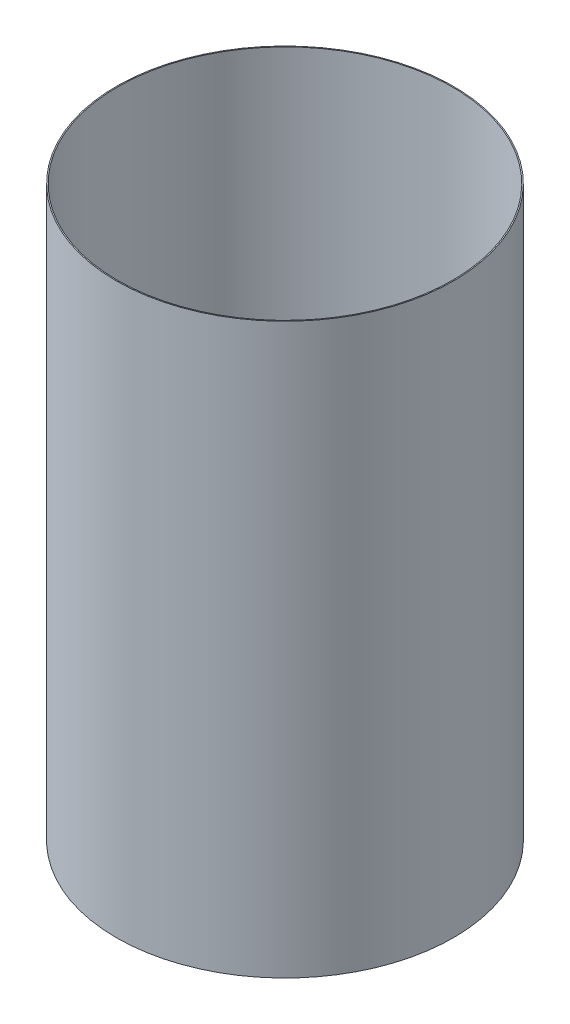
ISO-10303-21;
HEADER;
FILE_DESCRIPTION(('STEP AP214'),'2;1');
FILE_NAME('part.step','',(''),(''),'','','');
FILE_SCHEMA(('AUTOMOTIVE_DESIGN { 1 0 10303 214 1 1 1 1 }'));
ENDSEC;
DATA;
#1=APPLICATION_CONTEXT('core data for automotive mechanical design processes');
#2=APPLICATION_PROTOCOL_DEFINITION('international standard','automotive_design',2000,#1);
#3=PRODUCT_CONTEXT('',#1,'mechanical');
#4=PRODUCT('Part','Part','',(#3));
#5=PRODUCT_RELATED_PRODUCT_CATEGORY('part','',(#4));
#6=PRODUCT_DEFINITION_FORMATION('','',#4);
#7=PRODUCT_DEFINITION_CONTEXT('part definition',#1,'design');
#8=PRODUCT_DEFINITION('design','',#6,#7);
#9=PRODUCT_DEFINITION_SHAPE('','',#8);
#10=(LENGTH_UNIT() NAMED_UNIT(*) SI_UNIT(.MILLI.,.METRE.));
#11=(NAMED_UNIT(*) PLANE_ANGLE_UNIT() SI_UNIT($,.RADIAN.));
#12=(NAMED_UNIT(*) SI_UNIT($,.STERADIAN.) SOLID_ANGLE_UNIT());
#13=UNCERTAINTY_MEASURE_WITH_UNIT(LENGTH_MEASURE(1.E-05),#10,'distance_accuracy_value','');
#14=(GEOMETRIC_REPRESENTATION_CONTEXT(3) GLOBAL_UNCERTAINTY_ASSIGNED_CONTEXT((#13)) GLOBAL_UNIT_ASSIGNED_CONTEXT((#10,
#11,#12)) REPRESENTATION_CONTEXT('',''));
#15=CARTESIAN_POINT('',(0.,0.,0.));
#16=DIRECTION('',(0.,0.,1.));
#17=DIRECTION('',(1.,0.,0.));
#18=AXIS2_PLACEMENT_3D('',#15,#16,#17);
#19=CARTESIAN_POINT('',(0.,55.,0.));
#20=DIRECTION('',(0.,1.,0.));
#21=DIRECTION('',(0.,0.,1.));
#22=AXIS2_PLACEMENT_3D('',#19,#20,#21);
#23=CYLINDRICAL_SURFACE('',#22,39.5224);
#24=CARTESIAN_POINT('',(0.,-202.353193409573,0.));
#25=DIRECTION('',(0.,1.,0.));
#26=DIRECTION('',(0.,0.,1.));
#27=AXIS2_PLACEMENT_3D('',#24,#25,#26);
#28=CIRCLE('',#27,39.5224);
#29=CARTESIAN_POINT('',(0.,-202.353193409573,39.5224));
#30=VERTEX_POINT('',#29);
#31=EDGE_CURVE('E44',#30,#30,#28,.T.);
#32=ORIENTED_EDGE('',*,*,#31,.T.);
#33=EDGE_LOOP('',(#32));
#34=FACE_BOUND('',#33,.T.);
#35=CARTESIAN_POINT('',(0.,-69.0031934095732,0.));
#36=DIRECTION('',(0.,1.,0.));
#37=DIRECTION('',(0.,0.,1.));
#38=AXIS2_PLACEMENT_3D('',#35,#36,#37);
#39=CIRCLE('',#38,39.5224);
#40=CARTESIAN_POINT('',(0.,-69.0031934095732,39.5224));
#41=VERTEX_POINT('',#40);
#42=EDGE_CURVE('E10',#41,#41,#39,.T.);
#43=ORIENTED_EDGE('',*,*,#42,.F.);
#44=EDGE_LOOP('',(#43));
#45=FACE_BOUND('',#44,.T.);
#46=ADVANCED_FACE('F30',(#34,#45),#23,.T.);
#47=CARTESIAN_POINT('',(-39.5224,-69.0031934095732,0.));
#48=DIRECTION('',(0.,-1.,0.));
#49=DIRECTION('',(0.,0.,-1.));
#50=AXIS2_PLACEMENT_3D('',#47,#48,#49);
#51=PLANE('',#50);
#52=CARTESIAN_POINT('',(0.,-69.0031934095732,0.));
#53=DIRECTION('',(0.,1.,0.));
#54=DIRECTION('',(0.,0.,1.));
#55=AXIS2_PLACEMENT_3D('',#52,#53,#54);
#56=CIRCLE('',#55,39.2684);
#57=CARTESIAN_POINT('',(0.,-69.0031934095732,39.2684));
#58=VERTEX_POINT('',#57);
#59=EDGE_CURVE('E36',#58,#58,#56,.T.);
#60=ORIENTED_EDGE('',*,*,#59,.F.);
#61=EDGE_LOOP('',(#60));
#62=FACE_BOUND('',#61,.T.);
#63=ORIENTED_EDGE('',*,*,#42,.T.);
#64=EDGE_LOOP('',(#63));
#65=FACE_BOUND('',#64,.T.);
#66=ADVANCED_FACE('F60',(#62,#65),#51,.F.);
#67=CARTESIAN_POINT('',(0.,55.,0.));
#68=DIRECTION('',(0.,1.,0.));
#69=DIRECTION('',(0.,0.,1.));
#70=AXIS2_PLACEMENT_3D('',#67,#68,#69);
#71=CYLINDRICAL_SURFACE('',#70,39.2684);
#72=CARTESIAN_POINT('',(0.,-202.353193409573,0.));
#73=DIRECTION('',(0.,1.,0.));
#74=DIRECTION('',(0.,0.,1.));
#75=AXIS2_PLACEMENT_3D('',#72,#73,#74);
#76=CIRCLE('',#75,39.2684);
#77=CARTESIAN_POINT('',(0.,-202.353193409573,39.2684));
#78=VERTEX_POINT('',#77);
#79=EDGE_CURVE('E40',#78,#78,#76,.T.);
#80=ORIENTED_EDGE('',*,*,#79,.F.);
#81=EDGE_LOOP('',(#80));
#82=FACE_BOUND('',#81,.T.);
#83=ORIENTED_EDGE('',*,*,#59,.T.);
#84=EDGE_LOOP('',(#83));
#85=FACE_BOUND('',#84,.T.);
#86=ADVANCED_FACE('F55',(#82,#85),#71,.F.);
#87=CARTESIAN_POINT('',(-39.2684,-202.353193409573,0.));
#88=DIRECTION('',(0.,1.,0.));
#89=DIRECTION('',(0.,0.,1.));
#90=AXIS2_PLACEMENT_3D('',#87,#88,#89);
#91=PLANE('',#90);
#92=ORIENTED_EDGE('',*,*,#31,.F.);
#93=EDGE_LOOP('',(#92));
#94=FACE_BOUND('',#93,.T.);
#95=ORIENTED_EDGE('',*,*,#79,.T.);
#96=EDGE_LOOP('',(#95));
#97=FACE_BOUND('',#96,.T.);
#98=ADVANCED_FACE('F52',(#94,#97),#91,.F.);
#99=CLOSED_SHELL('',(#46,#66,#86,#98));
#100=MANIFOLD_SOLID_BREP('B2',#99);
#101=ADVANCED_BREP_SHAPE_REPRESENTATION('',(#18,#100),#14);
#102=SHAPE_DEFINITION_REPRESENTATION(#9,#101);
ENDSEC;
END-ISO-10303-21;
